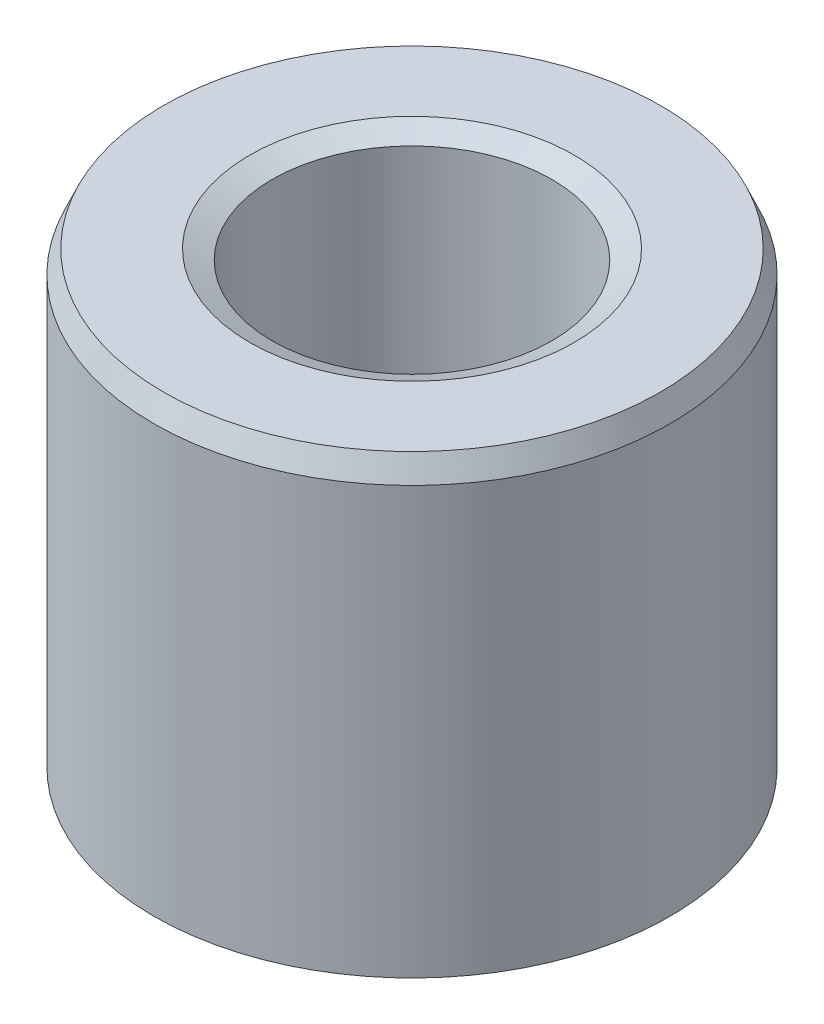
ISO-10303-21;
HEADER;
FILE_DESCRIPTION(('STEP AP214'),'2;1');
FILE_NAME('part.step','',(''),(''),'','','');
FILE_SCHEMA(('AUTOMOTIVE_DESIGN { 1 0 10303 214 1 1 1 1 }'));
ENDSEC;
DATA;
#1=APPLICATION_CONTEXT('core data for automotive mechanical design processes');
#2=APPLICATION_PROTOCOL_DEFINITION('international standard','automotive_design',2000,#1);
#3=PRODUCT_CONTEXT('',#1,'mechanical');
#4=PRODUCT('Part','Part','',(#3));
#5=PRODUCT_RELATED_PRODUCT_CATEGORY('part','',(#4));
#6=PRODUCT_DEFINITION_FORMATION('','',#4);
#7=PRODUCT_DEFINITION_CONTEXT('part definition',#1,'design');
#8=PRODUCT_DEFINITION('design','',#6,#7);
#9=PRODUCT_DEFINITION_SHAPE('','',#8);
#10=(LENGTH_UNIT() NAMED_UNIT(*) SI_UNIT(.MILLI.,.METRE.));
#11=(NAMED_UNIT(*) PLANE_ANGLE_UNIT() SI_UNIT($,.RADIAN.));
#12=(NAMED_UNIT(*) SI_UNIT($,.STERADIAN.) SOLID_ANGLE_UNIT());
#13=UNCERTAINTY_MEASURE_WITH_UNIT(LENGTH_MEASURE(1.E-05),#10,'distance_accuracy_value','');
#14=(GEOMETRIC_REPRESENTATION_CONTEXT(3) GLOBAL_UNCERTAINTY_ASSIGNED_CONTEXT((#13)) GLOBAL_UNIT_ASSIGNED_CONTEXT((#10,
#11,#12)) REPRESENTATION_CONTEXT('',''));
#15=CARTESIAN_POINT('',(0.,0.,0.));
#16=DIRECTION('',(0.,0.,1.));
#17=DIRECTION('',(1.,0.,0.));
#18=AXIS2_PLACEMENT_3D('',#15,#16,#17);
#19=CARTESIAN_POINT('',(0.,53.310525626169,0.));
#20=DIRECTION('',(0.,-1.,0.));
#21=DIRECTION('',(0.,0.,-1.));
#22=AXIS2_PLACEMENT_3D('',#19,#20,#21);
#23=CYLINDRICAL_SURFACE('',#22,30.);
#24=CARTESIAN_POINT('',(0.,1.14045633243883,0.));
#25=DIRECTION('',(0.,1.,0.));
#26=DIRECTION('',(0.,0.,1.));
#27=AXIS2_PLACEMENT_3D('',#24,#25,#26);
#28=CIRCLE('',#27,30.);
#29=CARTESIAN_POINT('',(0.,1.14045633243883,30.));
#30=VERTEX_POINT('',#29);
#31=EDGE_CURVE('E10',#30,#30,#28,.T.);
#32=ORIENTED_EDGE('',*,*,#31,.T.);
#33=EDGE_LOOP('',(#32));
#34=FACE_BOUND('',#33,.T.);
#35=CARTESIAN_POINT('',(0.,50.7055698298514,0.));
#36=DIRECTION('',(0.,1.,0.));
#37=DIRECTION('',(0.,0.,1.));
#38=AXIS2_PLACEMENT_3D('',#35,#36,#37);
#39=CIRCLE('',#38,30.);
#40=CARTESIAN_POINT('',(0.,50.7055698298514,30.));
#41=VERTEX_POINT('',#40);
#42=EDGE_CURVE('E50',#41,#41,#39,.F.);
#43=ORIENTED_EDGE('',*,*,#42,.T.);
#44=EDGE_LOOP('',(#43));
#45=FACE_BOUND('',#44,.T.);
#46=ADVANCED_FACE('F39',(#34,#45),#23,.T.);
#47=CARTESIAN_POINT('',(0.,53.310525626169,0.));
#48=DIRECTION('',(0.,1.,0.));
#49=DIRECTION('',(0.,0.,1.));
#50=AXIS2_PLACEMENT_3D('',#47,#48,#49);
#51=PLANE('',#50);
#52=CARTESIAN_POINT('',(0.,53.310525626169,0.));
#53=DIRECTION('',(0.,1.,0.));
#54=DIRECTION('',(0.,0.,1.));
#55=AXIS2_PLACEMENT_3D('',#52,#53,#54);
#56=CIRCLE('',#55,18.8575684878688);
#57=CARTESIAN_POINT('',(0.,53.310525626169,18.8575684878688));
#58=VERTEX_POINT('',#57);
#59=EDGE_CURVE('E58',#58,#58,#56,.F.);
#60=ORIENTED_EDGE('',*,*,#59,.T.);
#61=EDGE_LOOP('',(#60));
#62=FACE_BOUND('',#61,.T.);
#63=CARTESIAN_POINT('',(0.,53.310525626169,0.));
#64=DIRECTION('',(0.,1.,0.));
#65=DIRECTION('',(0.,0.,1.));
#66=AXIS2_PLACEMENT_3D('',#63,#64,#65);
#67=CIRCLE('',#66,28.8595436675612);
#68=CARTESIAN_POINT('',(0.,53.310525626169,28.8595436675612));
#69=VERTEX_POINT('',#68);
#70=EDGE_CURVE('E61',#69,#69,#67,.T.);
#71=ORIENTED_EDGE('',*,*,#70,.T.);
#72=EDGE_LOOP('',(#71));
#73=FACE_BOUND('',#72,.T.);
#74=ADVANCED_FACE('F88',(#62,#73),#51,.T.);
#75=CARTESIAN_POINT('',(0.,0.,0.));
#76=DIRECTION('',(0.,1.,0.));
#77=DIRECTION('',(0.,0.,1.));
#78=AXIS2_PLACEMENT_3D('',#75,#76,#77);
#79=PLANE('',#78);
#80=CARTESIAN_POINT('',(0.,0.,0.));
#81=DIRECTION('',(0.,1.,0.));
#82=DIRECTION('',(0.,0.,1.));
#83=AXIS2_PLACEMENT_3D('',#80,#81,#82);
#84=CIRCLE('',#83,17.3930690239901);
#85=CARTESIAN_POINT('',(0.,0.,17.3930690239901));
#86=VERTEX_POINT('',#85);
#87=EDGE_CURVE('E51',#86,#86,#84,.T.);
#88=ORIENTED_EDGE('',*,*,#87,.T.);
#89=EDGE_LOOP('',(#88));
#90=FACE_BOUND('',#89,.T.);
#91=CARTESIAN_POINT('',(0.,0.,0.));
#92=DIRECTION('',(0.,1.,0.));
#93=DIRECTION('',(0.,0.,1.));
#94=AXIS2_PLACEMENT_3D('',#91,#92,#93);
#95=CIRCLE('',#94,27.3950442036825);
#96=CARTESIAN_POINT('',(0.,0.,27.3950442036825));
#97=VERTEX_POINT('',#96);
#98=EDGE_CURVE('E54',#97,#97,#95,.F.);
#99=ORIENTED_EDGE('',*,*,#98,.T.);
#100=EDGE_LOOP('',(#99));
#101=FACE_BOUND('',#100,.T.);
#102=ADVANCED_FACE('F83',(#90,#101),#79,.F.);
#103=CARTESIAN_POINT('',(0.,53.310525626169,0.));
#104=DIRECTION('',(0.,-1.,0.));
#105=DIRECTION('',(0.,0.,-1.));
#106=AXIS2_PLACEMENT_3D('',#103,#104,#105);
#107=CYLINDRICAL_SURFACE('',#106,16.2526126915512);
#108=CARTESIAN_POINT('',(0.,52.1700692937301,0.));
#109=DIRECTION('',(0.,1.,0.));
#110=DIRECTION('',(0.,0.,1.));
#111=AXIS2_PLACEMENT_3D('',#108,#109,#110);
#112=CIRCLE('',#111,16.2526126915512);
#113=CARTESIAN_POINT('',(0.,52.1700692937301,16.2526126915512));
#114=VERTEX_POINT('',#113);
#115=EDGE_CURVE('E67',#114,#114,#112,.T.);
#116=ORIENTED_EDGE('',*,*,#115,.T.);
#117=EDGE_LOOP('',(#116));
#118=FACE_BOUND('',#117,.T.);
#119=CARTESIAN_POINT('',(0.,2.60495579631755,0.));
#120=DIRECTION('',(0.,1.,0.));
#121=DIRECTION('',(0.,0.,1.));
#122=AXIS2_PLACEMENT_3D('',#119,#120,#121);
#123=CIRCLE('',#122,16.2526126915512);
#124=CARTESIAN_POINT('',(0.,2.60495579631755,16.2526126915512));
#125=VERTEX_POINT('',#124);
#126=EDGE_CURVE('E69',#125,#125,#123,.F.);
#127=ORIENTED_EDGE('',*,*,#126,.T.);
#128=EDGE_LOOP('',(#127));
#129=FACE_BOUND('',#128,.T.);
#130=ADVANCED_FACE('F71',(#118,#129),#107,.F.);
#131=CARTESIAN_POINT('',(0.,52.1700692937301,0.));
#132=DIRECTION('',(0.,1.,0.));
#133=DIRECTION('',(0.,0.,1.));
#134=AXIS2_PLACEMENT_3D('',#131,#132,#133);
#135=CONICAL_SURFACE('',#134,16.2526126915512,1.15813195622069);
#136=ORIENTED_EDGE('',*,*,#59,.F.);
#137=EDGE_LOOP('',(#136));
#138=FACE_BOUND('',#137,.T.);
#139=ORIENTED_EDGE('',*,*,#115,.F.);
#140=EDGE_LOOP('',(#139));
#141=FACE_BOUND('',#140,.T.);
#142=ADVANCED_FACE('F77',(#138,#141),#135,.F.);
#143=CARTESIAN_POINT('',(0.,0.,0.));
#144=DIRECTION('',(0.,-1.,0.));
#145=DIRECTION('',(0.,0.,-1.));
#146=AXIS2_PLACEMENT_3D('',#143,#144,#145);
#147=CONICAL_SURFACE('',#146,17.3930690239901,0.412664370574206);
#148=ORIENTED_EDGE('',*,*,#126,.F.);
#149=EDGE_LOOP('',(#148));
#150=FACE_BOUND('',#149,.T.);
#151=ORIENTED_EDGE('',*,*,#87,.F.);
#152=EDGE_LOOP('',(#151));
#153=FACE_BOUND('',#152,.T.);
#154=ADVANCED_FACE('F73',(#150,#153),#147,.F.);
#155=CARTESIAN_POINT('',(0.,1.14045633243883,0.));
#156=DIRECTION('',(0.,1.,0.));
#157=DIRECTION('',(0.,0.,1.));
#158=AXIS2_PLACEMENT_3D('',#155,#156,#157);
#159=CONICAL_SURFACE('',#158,30.,1.15813195622069);
#160=ORIENTED_EDGE('',*,*,#98,.F.);
#161=EDGE_LOOP('',(#160));
#162=FACE_BOUND('',#161,.T.);
#163=ORIENTED_EDGE('',*,*,#31,.F.);
#164=EDGE_LOOP('',(#163));
#165=FACE_BOUND('',#164,.T.);
#166=ADVANCED_FACE('F76',(#162,#165),#159,.T.);
#167=CARTESIAN_POINT('',(0.,53.310525626169,0.));
#168=DIRECTION('',(0.,-1.,0.));
#169=DIRECTION('',(0.,0.,-1.));
#170=AXIS2_PLACEMENT_3D('',#167,#168,#169);
#171=CONICAL_SURFACE('',#170,28.8595436675612,0.412664370574209);
#172=ORIENTED_EDGE('',*,*,#42,.F.);
#173=EDGE_LOOP('',(#172));
#174=FACE_BOUND('',#173,.T.);
#175=ORIENTED_EDGE('',*,*,#70,.F.);
#176=EDGE_LOOP('',(#175));
#177=FACE_BOUND('',#176,.T.);
#178=ADVANCED_FACE('F45',(#174,#177),#171,.T.);
#179=CLOSED_SHELL('',(#46,#74,#102,#130,#142,#154,#166,#178));
#180=MANIFOLD_SOLID_BREP('B2',#179);
#181=ADVANCED_BREP_SHAPE_REPRESENTATION('',(#18,#180),#14);
#182=SHAPE_DEFINITION_REPRESENTATION(#9,#181);
ENDSEC;
END-ISO-10303-21;
